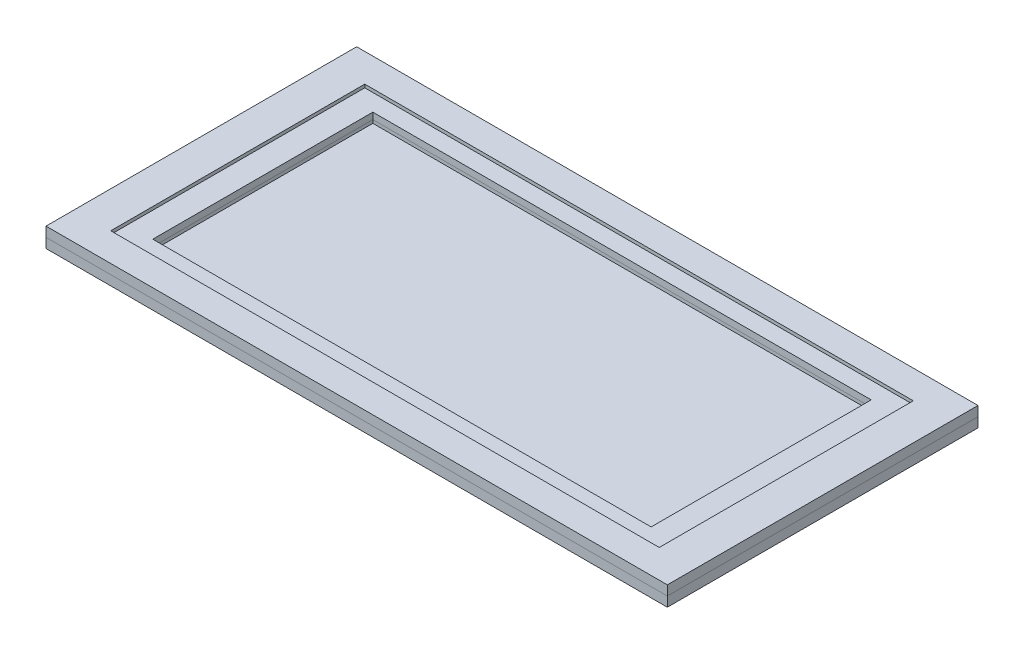
ISO-10303-21;
HEADER;
FILE_DESCRIPTION(('STEP AP214'),'2;1');
FILE_NAME('part.step','',(''),(''),'','','');
FILE_SCHEMA(('AUTOMOTIVE_DESIGN { 1 0 10303 214 1 1 1 1 }'));
ENDSEC;
DATA;
#1=APPLICATION_CONTEXT('core data for automotive mechanical design processes');
#2=APPLICATION_PROTOCOL_DEFINITION('international standard','automotive_design',2000,#1);
#3=PRODUCT_CONTEXT('',#1,'mechanical');
#4=PRODUCT('Part','Part','',(#3));
#5=PRODUCT_RELATED_PRODUCT_CATEGORY('part','',(#4));
#6=PRODUCT_DEFINITION_FORMATION('','',#4);
#7=PRODUCT_DEFINITION_CONTEXT('part definition',#1,'design');
#8=PRODUCT_DEFINITION('design','',#6,#7);
#9=PRODUCT_DEFINITION_SHAPE('','',#8);
#10=(LENGTH_UNIT() NAMED_UNIT(*) SI_UNIT(.MILLI.,.METRE.));
#11=(NAMED_UNIT(*) PLANE_ANGLE_UNIT() SI_UNIT($,.RADIAN.));
#12=(NAMED_UNIT(*) SI_UNIT($,.STERADIAN.) SOLID_ANGLE_UNIT());
#13=UNCERTAINTY_MEASURE_WITH_UNIT(LENGTH_MEASURE(1.E-05),#10,'distance_accuracy_value','');
#14=(GEOMETRIC_REPRESENTATION_CONTEXT(3) GLOBAL_UNCERTAINTY_ASSIGNED_CONTEXT((#13)) GLOBAL_UNIT_ASSIGNED_CONTEXT((#10,
#11,#12)) REPRESENTATION_CONTEXT('',''));
#15=CARTESIAN_POINT('',(0.,0.,0.));
#16=DIRECTION('',(0.,0.,1.));
#17=DIRECTION('',(1.,0.,0.));
#18=AXIS2_PLACEMENT_3D('',#15,#16,#17);
#19=CARTESIAN_POINT('',(-609.6,38.1,304.8));
#20=DIRECTION('',(1.,0.,0.));
#21=DIRECTION('',(0.,0.,-1.));
#22=AXIS2_PLACEMENT_3D('',#19,#20,#21);
#23=PLANE('',#22);
#24=DIRECTION('',(0.,0.,1.));
#25=VECTOR('',#24,1.);
#26=CARTESIAN_POINT('',(-609.6,19.05,304.8));
#27=LINE('',#26,#25);
#28=CARTESIAN_POINT('',(-609.6,19.05,-304.8));
#29=VERTEX_POINT('',#28);
#30=CARTESIAN_POINT('',(-609.6,19.05,304.8));
#31=VERTEX_POINT('',#30);
#32=EDGE_CURVE('E194',#29,#31,#27,.T.);
#33=ORIENTED_EDGE('',*,*,#32,.T.);
#34=DIRECTION('',(0.,-1.,0.));
#35=VECTOR('',#34,1.);
#36=CARTESIAN_POINT('',(-609.6,38.1,304.8));
#37=LINE('',#36,#35);
#38=CARTESIAN_POINT('',(-609.6,38.1,304.8));
#39=VERTEX_POINT('',#38);
#40=EDGE_CURVE('E12',#39,#31,#37,.T.);
#41=ORIENTED_EDGE('',*,*,#40,.F.);
#42=DIRECTION('',(0.,0.,1.));
#43=VECTOR('',#42,1.);
#44=CARTESIAN_POINT('',(-609.6,38.1,304.8));
#45=LINE('',#44,#43);
#46=CARTESIAN_POINT('',(-609.6,38.1,-304.8));
#47=VERTEX_POINT('',#46);
#48=EDGE_CURVE('E201',#47,#39,#45,.T.);
#49=ORIENTED_EDGE('',*,*,#48,.F.);
#50=DIRECTION('',(0.,-1.,0.));
#51=VECTOR('',#50,1.);
#52=CARTESIAN_POINT('',(-609.6,38.1,-304.8));
#53=LINE('',#52,#51);
#54=EDGE_CURVE('E211',#47,#29,#53,.T.);
#55=ORIENTED_EDGE('',*,*,#54,.T.);
#56=EDGE_LOOP('',(#33,#41,#49,#55));
#57=FACE_BOUND('',#56,.T.);
#58=ADVANCED_FACE('F43',(#57),#23,.F.);
#59=CARTESIAN_POINT('',(609.6,38.1,304.8));
#60=DIRECTION('',(0.,0.,-1.));
#61=DIRECTION('',(-1.,0.,0.));
#62=AXIS2_PLACEMENT_3D('',#59,#60,#61);
#63=PLANE('',#62);
#64=DIRECTION('',(1.,0.,0.));
#65=VECTOR('',#64,1.);
#66=CARTESIAN_POINT('',(609.6,19.05,304.8));
#67=LINE('',#66,#65);
#68=CARTESIAN_POINT('',(609.6,19.05,304.8));
#69=VERTEX_POINT('',#68);
#70=EDGE_CURVE('E214',#31,#69,#67,.T.);
#71=ORIENTED_EDGE('',*,*,#70,.T.);
#72=DIRECTION('',(0.,-1.,0.));
#73=VECTOR('',#72,1.);
#74=CARTESIAN_POINT('',(609.6,38.1,304.8));
#75=LINE('',#74,#73);
#76=CARTESIAN_POINT('',(609.6,38.1,304.8));
#77=VERTEX_POINT('',#76);
#78=EDGE_CURVE('E50',#77,#69,#75,.T.);
#79=ORIENTED_EDGE('',*,*,#78,.F.);
#80=DIRECTION('',(1.,0.,0.));
#81=VECTOR('',#80,1.);
#82=CARTESIAN_POINT('',(609.6,38.1,304.8));
#83=LINE('',#82,#81);
#84=EDGE_CURVE('E204',#39,#77,#83,.T.);
#85=ORIENTED_EDGE('',*,*,#84,.F.);
#86=ORIENTED_EDGE('',*,*,#40,.T.);
#87=EDGE_LOOP('',(#71,#79,#85,#86));
#88=FACE_BOUND('',#87,.T.);
#89=ADVANCED_FACE('F244',(#88),#63,.F.);
#90=CARTESIAN_POINT('',(609.6,38.1,304.8));
#91=DIRECTION('',(-1.,0.,0.));
#92=DIRECTION('',(0.,0.,1.));
#93=AXIS2_PLACEMENT_3D('',#90,#91,#92);
#94=PLANE('',#93);
#95=DIRECTION('',(0.,0.,-1.));
#96=VECTOR('',#95,1.);
#97=CARTESIAN_POINT('',(609.6,19.05,304.8));
#98=LINE('',#97,#96);
#99=CARTESIAN_POINT('',(609.6,19.05,-304.8));
#100=VERTEX_POINT('',#99);
#101=EDGE_CURVE('E216',#69,#100,#98,.T.);
#102=ORIENTED_EDGE('',*,*,#101,.T.);
#103=DIRECTION('',(0.,-1.,0.));
#104=VECTOR('',#103,1.);
#105=CARTESIAN_POINT('',(609.6,38.1,-304.8));
#106=LINE('',#105,#104);
#107=CARTESIAN_POINT('',(609.6,38.1,-304.8));
#108=VERTEX_POINT('',#107);
#109=EDGE_CURVE('E221',#108,#100,#106,.T.);
#110=ORIENTED_EDGE('',*,*,#109,.F.);
#111=DIRECTION('',(0.,0.,-1.));
#112=VECTOR('',#111,1.);
#113=CARTESIAN_POINT('',(609.6,38.1,304.8));
#114=LINE('',#113,#112);
#115=EDGE_CURVE('E207',#77,#108,#114,.T.);
#116=ORIENTED_EDGE('',*,*,#115,.F.);
#117=ORIENTED_EDGE('',*,*,#78,.T.);
#118=EDGE_LOOP('',(#102,#110,#116,#117));
#119=FACE_BOUND('',#118,.T.);
#120=ADVANCED_FACE('F228',(#119),#94,.F.);
#121=CARTESIAN_POINT('',(609.6,38.1,-304.8));
#122=DIRECTION('',(0.,0.,1.));
#123=DIRECTION('',(1.,0.,0.));
#124=AXIS2_PLACEMENT_3D('',#121,#122,#123);
#125=PLANE('',#124);
#126=DIRECTION('',(-1.,0.,0.));
#127=VECTOR('',#126,1.);
#128=CARTESIAN_POINT('',(609.6,19.05,-304.8));
#129=LINE('',#128,#127);
#130=EDGE_CURVE('E205',#100,#29,#129,.T.);
#131=ORIENTED_EDGE('',*,*,#130,.T.);
#132=ORIENTED_EDGE('',*,*,#54,.F.);
#133=DIRECTION('',(-1.,0.,0.));
#134=VECTOR('',#133,1.);
#135=CARTESIAN_POINT('',(609.6,38.1,-304.8));
#136=LINE('',#135,#134);
#137=EDGE_CURVE('E209',#108,#47,#136,.T.);
#138=ORIENTED_EDGE('',*,*,#137,.F.);
#139=ORIENTED_EDGE('',*,*,#109,.T.);
#140=EDGE_LOOP('',(#131,#132,#138,#139));
#141=FACE_BOUND('',#140,.T.);
#142=ADVANCED_FACE('F237',(#141),#125,.F.);
#143=CARTESIAN_POINT('',(0.,38.1,0.));
#144=DIRECTION('',(0.,1.,0.));
#145=DIRECTION('',(0.,0.,1.));
#146=AXIS2_PLACEMENT_3D('',#143,#144,#145);
#147=PLANE('',#146);
#148=DIRECTION('',(0.,0.,1.));
#149=VECTOR('',#148,1.);
#150=CARTESIAN_POINT('',(-538.1625,38.1,249.2375));
#151=LINE('',#150,#149);
#152=CARTESIAN_POINT('',(-538.1625,38.1,-249.2375));
#153=VERTEX_POINT('',#152);
#154=CARTESIAN_POINT('',(-538.1625,38.1,249.2375));
#155=VERTEX_POINT('',#154);
#156=EDGE_CURVE('E168',#153,#155,#151,.T.);
#157=ORIENTED_EDGE('',*,*,#156,.F.);
#158=DIRECTION('',(-1.,0.,0.));
#159=VECTOR('',#158,1.);
#160=CARTESIAN_POINT('',(538.1625,38.1,-249.2375));
#161=LINE('',#160,#159);
#162=CARTESIAN_POINT('',(538.1625,38.1,-249.2375));
#163=VERTEX_POINT('',#162);
#164=EDGE_CURVE('E173',#163,#153,#161,.T.);
#165=ORIENTED_EDGE('',*,*,#164,.F.);
#166=DIRECTION('',(0.,0.,-1.));
#167=VECTOR('',#166,1.);
#168=CARTESIAN_POINT('',(538.1625,38.1,249.2375));
#169=LINE('',#168,#167);
#170=CARTESIAN_POINT('',(538.1625,38.1,249.2375));
#171=VERTEX_POINT('',#170);
#172=EDGE_CURVE('E187',#171,#163,#169,.T.);
#173=ORIENTED_EDGE('',*,*,#172,.F.);
#174=DIRECTION('',(1.,0.,0.));
#175=VECTOR('',#174,1.);
#176=CARTESIAN_POINT('',(538.1625,38.1,249.2375));
#177=LINE('',#176,#175);
#178=EDGE_CURVE('E184',#155,#171,#177,.T.);
#179=ORIENTED_EDGE('',*,*,#178,.F.);
#180=EDGE_LOOP('',(#157,#165,#173,#179));
#181=FACE_BOUND('',#180,.T.);
#182=ORIENTED_EDGE('',*,*,#48,.T.);
#183=ORIENTED_EDGE('',*,*,#84,.T.);
#184=ORIENTED_EDGE('',*,*,#115,.T.);
#185=ORIENTED_EDGE('',*,*,#137,.T.);
#186=EDGE_LOOP('',(#182,#183,#184,#185));
#187=FACE_BOUND('',#186,.T.);
#188=ADVANCED_FACE('F243',(#181,#187),#147,.T.);
#189=CARTESIAN_POINT('',(0.,19.05,0.));
#190=DIRECTION('',(0.,1.,0.));
#191=DIRECTION('',(0.,0.,1.));
#192=AXIS2_PLACEMENT_3D('',#189,#190,#191);
#193=PLANE('',#192);
#194=DIRECTION('',(-1.,0.,0.));
#195=VECTOR('',#194,1.);
#196=CARTESIAN_POINT('',(0.,19.05,-215.9));
#197=LINE('',#196,#195);
#198=CARTESIAN_POINT('',(488.95,19.05,-215.9));
#199=VERTEX_POINT('',#198);
#200=CARTESIAN_POINT('',(-488.95,19.05,-215.9));
#201=VERTEX_POINT('',#200);
#202=EDGE_CURVE('E162',#199,#201,#197,.T.);
#203=ORIENTED_EDGE('',*,*,#202,.T.);
#204=DIRECTION('',(0.,0.,1.));
#205=VECTOR('',#204,1.);
#206=CARTESIAN_POINT('',(-488.95,19.05,0.));
#207=LINE('',#206,#205);
#208=CARTESIAN_POINT('',(-488.95,19.05,215.9));
#209=VERTEX_POINT('',#208);
#210=EDGE_CURVE('E165',#201,#209,#207,.T.);
#211=ORIENTED_EDGE('',*,*,#210,.T.);
#212=DIRECTION('',(1.,0.,0.));
#213=VECTOR('',#212,1.);
#214=CARTESIAN_POINT('',(0.,19.05,215.9));
#215=LINE('',#214,#213);
#216=CARTESIAN_POINT('',(488.95,19.05,215.9));
#217=VERTEX_POINT('',#216);
#218=EDGE_CURVE('E157',#209,#217,#215,.T.);
#219=ORIENTED_EDGE('',*,*,#218,.T.);
#220=DIRECTION('',(0.,0.,-1.));
#221=VECTOR('',#220,1.);
#222=CARTESIAN_POINT('',(488.95,19.05,0.));
#223=LINE('',#222,#221);
#224=EDGE_CURVE('E137',#217,#199,#223,.T.);
#225=ORIENTED_EDGE('',*,*,#224,.T.);
#226=EDGE_LOOP('',(#203,#211,#219,#225));
#227=FACE_BOUND('',#226,.T.);
#228=ORIENTED_EDGE('',*,*,#32,.F.);
#229=ORIENTED_EDGE('',*,*,#130,.F.);
#230=ORIENTED_EDGE('',*,*,#101,.F.);
#231=ORIENTED_EDGE('',*,*,#70,.F.);
#232=EDGE_LOOP('',(#228,#229,#230,#231));
#233=FACE_BOUND('',#232,.T.);
#234=ADVANCED_FACE('F234',(#227,#233),#193,.F.);
#235=CARTESIAN_POINT('',(-538.1625,31.75,249.2375));
#236=DIRECTION('',(-1.,0.,0.));
#237=DIRECTION('',(0.,0.,1.));
#238=AXIS2_PLACEMENT_3D('',#235,#236,#237);
#239=PLANE('',#238);
#240=ORIENTED_EDGE('',*,*,#156,.T.);
#241=DIRECTION('',(0.,1.,0.));
#242=VECTOR('',#241,1.);
#243=CARTESIAN_POINT('',(-538.1625,31.75,249.2375));
#244=LINE('',#243,#242);
#245=CARTESIAN_POINT('',(-538.1625,31.75,249.2375));
#246=VERTEX_POINT('',#245);
#247=EDGE_CURVE('E182',#246,#155,#244,.T.);
#248=ORIENTED_EDGE('',*,*,#247,.F.);
#249=DIRECTION('',(0.,0.,1.));
#250=VECTOR('',#249,1.);
#251=CARTESIAN_POINT('',(-538.1625,31.75,249.2375));
#252=LINE('',#251,#250);
#253=CARTESIAN_POINT('',(-538.1625,31.75,-249.2375));
#254=VERTEX_POINT('',#253);
#255=EDGE_CURVE('E169',#254,#246,#252,.T.);
#256=ORIENTED_EDGE('',*,*,#255,.F.);
#257=DIRECTION('',(0.,1.,0.));
#258=VECTOR('',#257,1.);
#259=CARTESIAN_POINT('',(-538.1625,31.75,-249.2375));
#260=LINE('',#259,#258);
#261=EDGE_CURVE('E192',#254,#153,#260,.T.);
#262=ORIENTED_EDGE('',*,*,#261,.T.);
#263=EDGE_LOOP('',(#240,#248,#256,#262));
#264=FACE_BOUND('',#263,.T.);
#265=ADVANCED_FACE('F256',(#264),#239,.F.);
#266=CARTESIAN_POINT('',(538.1625,31.75,-249.2375));
#267=DIRECTION('',(0.,0.,-1.));
#268=DIRECTION('',(-1.,0.,0.));
#269=AXIS2_PLACEMENT_3D('',#266,#267,#268);
#270=PLANE('',#269);
#271=ORIENTED_EDGE('',*,*,#164,.T.);
#272=ORIENTED_EDGE('',*,*,#261,.F.);
#273=DIRECTION('',(-1.,0.,0.));
#274=VECTOR('',#273,1.);
#275=CARTESIAN_POINT('',(538.1625,31.75,-249.2375));
#276=LINE('',#275,#274);
#277=CARTESIAN_POINT('',(538.1625,31.75,-249.2375));
#278=VERTEX_POINT('',#277);
#279=EDGE_CURVE('E179',#278,#254,#276,.T.);
#280=ORIENTED_EDGE('',*,*,#279,.F.);
#281=DIRECTION('',(0.,1.,0.));
#282=VECTOR('',#281,1.);
#283=CARTESIAN_POINT('',(538.1625,31.75,-249.2375));
#284=LINE('',#283,#282);
#285=EDGE_CURVE('E195',#278,#163,#284,.T.);
#286=ORIENTED_EDGE('',*,*,#285,.T.);
#287=EDGE_LOOP('',(#271,#272,#280,#286));
#288=FACE_BOUND('',#287,.T.);
#289=ADVANCED_FACE('F263',(#288),#270,.F.);
#290=CARTESIAN_POINT('',(538.1625,31.75,249.2375));
#291=DIRECTION('',(1.,0.,0.));
#292=DIRECTION('',(0.,0.,-1.));
#293=AXIS2_PLACEMENT_3D('',#290,#291,#292);
#294=PLANE('',#293);
#295=ORIENTED_EDGE('',*,*,#172,.T.);
#296=ORIENTED_EDGE('',*,*,#285,.F.);
#297=DIRECTION('',(0.,0.,-1.));
#298=VECTOR('',#297,1.);
#299=CARTESIAN_POINT('',(538.1625,31.75,249.2375));
#300=LINE('',#299,#298);
#301=CARTESIAN_POINT('',(538.1625,31.75,249.2375));
#302=VERTEX_POINT('',#301);
#303=EDGE_CURVE('E176',#302,#278,#300,.T.);
#304=ORIENTED_EDGE('',*,*,#303,.F.);
#305=DIRECTION('',(0.,1.,0.));
#306=VECTOR('',#305,1.);
#307=CARTESIAN_POINT('',(538.1625,31.75,249.2375));
#308=LINE('',#307,#306);
#309=EDGE_CURVE('E197',#302,#171,#308,.T.);
#310=ORIENTED_EDGE('',*,*,#309,.T.);
#311=EDGE_LOOP('',(#295,#296,#304,#310));
#312=FACE_BOUND('',#311,.T.);
#313=ADVANCED_FACE('F268',(#312),#294,.F.);
#314=CARTESIAN_POINT('',(538.1625,31.75,249.2375));
#315=DIRECTION('',(0.,0.,1.));
#316=DIRECTION('',(1.,0.,0.));
#317=AXIS2_PLACEMENT_3D('',#314,#315,#316);
#318=PLANE('',#317);
#319=ORIENTED_EDGE('',*,*,#178,.T.);
#320=ORIENTED_EDGE('',*,*,#309,.F.);
#321=DIRECTION('',(1.,0.,0.));
#322=VECTOR('',#321,1.);
#323=CARTESIAN_POINT('',(538.1625,31.75,249.2375));
#324=LINE('',#323,#322);
#325=EDGE_CURVE('E172',#246,#302,#324,.T.);
#326=ORIENTED_EDGE('',*,*,#325,.F.);
#327=ORIENTED_EDGE('',*,*,#247,.T.);
#328=EDGE_LOOP('',(#319,#320,#326,#327));
#329=FACE_BOUND('',#328,.T.);
#330=ADVANCED_FACE('F265',(#329),#318,.F.);
#331=CARTESIAN_POINT('',(0.,31.75,0.));
#332=DIRECTION('',(0.,1.,0.));
#333=DIRECTION('',(0.,0.,1.));
#334=AXIS2_PLACEMENT_3D('',#331,#332,#333);
#335=PLANE('',#334);
#336=DIRECTION('',(0.,0.,1.));
#337=VECTOR('',#336,1.);
#338=CARTESIAN_POINT('',(-488.95,31.75,215.9));
#339=LINE('',#338,#337);
#340=CARTESIAN_POINT('',(-488.95,31.75,-215.9));
#341=VERTEX_POINT('',#340);
#342=CARTESIAN_POINT('',(-488.95,31.75,215.9));
#343=VERTEX_POINT('',#342);
#344=EDGE_CURVE('E65',#341,#343,#339,.T.);
#345=ORIENTED_EDGE('',*,*,#344,.F.);
#346=DIRECTION('',(-1.,0.,0.));
#347=VECTOR('',#346,1.);
#348=CARTESIAN_POINT('',(488.95,31.75,-215.9));
#349=LINE('',#348,#347);
#350=CARTESIAN_POINT('',(488.95,31.75,-215.9));
#351=VERTEX_POINT('',#350);
#352=EDGE_CURVE('E150',#351,#341,#349,.T.);
#353=ORIENTED_EDGE('',*,*,#352,.F.);
#354=DIRECTION('',(0.,0.,-1.));
#355=VECTOR('',#354,1.);
#356=CARTESIAN_POINT('',(488.95,31.75,215.9));
#357=LINE('',#356,#355);
#358=CARTESIAN_POINT('',(488.95,31.75,215.9));
#359=VERTEX_POINT('',#358);
#360=EDGE_CURVE('E134',#359,#351,#357,.T.);
#361=ORIENTED_EDGE('',*,*,#360,.F.);
#362=DIRECTION('',(1.,0.,0.));
#363=VECTOR('',#362,1.);
#364=CARTESIAN_POINT('',(488.95,31.75,215.9));
#365=LINE('',#364,#363);
#366=EDGE_CURVE('E143',#343,#359,#365,.T.);
#367=ORIENTED_EDGE('',*,*,#366,.F.);
#368=EDGE_LOOP('',(#345,#353,#361,#367));
#369=FACE_BOUND('',#368,.T.);
#370=ORIENTED_EDGE('',*,*,#255,.T.);
#371=ORIENTED_EDGE('',*,*,#325,.T.);
#372=ORIENTED_EDGE('',*,*,#303,.T.);
#373=ORIENTED_EDGE('',*,*,#279,.T.);
#374=EDGE_LOOP('',(#370,#371,#372,#373));
#375=FACE_BOUND('',#374,.T.);
#376=ADVANCED_FACE('F147',(#369,#375),#335,.T.);
#377=CARTESIAN_POINT('',(-488.95,12.7,215.9));
#378=DIRECTION('',(-1.,0.,0.));
#379=DIRECTION('',(0.,0.,1.));
#380=AXIS2_PLACEMENT_3D('',#377,#378,#379);
#381=PLANE('',#380);
#382=DIRECTION('',(0.,1.,0.));
#383=VECTOR('',#382,1.);
#384=CARTESIAN_POINT('',(-488.95,12.7,-215.9));
#385=LINE('',#384,#383);
#386=EDGE_CURVE('E155',#201,#341,#385,.T.);
#387=ORIENTED_EDGE('',*,*,#386,.T.);
#388=ORIENTED_EDGE('',*,*,#344,.T.);
#389=DIRECTION('',(0.,1.,0.));
#390=VECTOR('',#389,1.);
#391=CARTESIAN_POINT('',(-488.95,12.7,215.9));
#392=LINE('',#391,#390);
#393=EDGE_CURVE('E140',#209,#343,#392,.T.);
#394=ORIENTED_EDGE('',*,*,#393,.F.);
#395=ORIENTED_EDGE('',*,*,#210,.F.);
#396=EDGE_LOOP('',(#387,#388,#394,#395));
#397=FACE_BOUND('',#396,.T.);
#398=ADVANCED_FACE('F278',(#397),#381,.F.);
#399=CARTESIAN_POINT('',(488.95,12.7,-215.9));
#400=DIRECTION('',(0.,0.,-1.));
#401=DIRECTION('',(-1.,0.,0.));
#402=AXIS2_PLACEMENT_3D('',#399,#400,#401);
#403=PLANE('',#402);
#404=DIRECTION('',(0.,1.,0.));
#405=VECTOR('',#404,1.);
#406=CARTESIAN_POINT('',(488.95,12.7,-215.9));
#407=LINE('',#406,#405);
#408=EDGE_CURVE('E139',#199,#351,#407,.T.);
#409=ORIENTED_EDGE('',*,*,#408,.T.);
#410=ORIENTED_EDGE('',*,*,#352,.T.);
#411=ORIENTED_EDGE('',*,*,#386,.F.);
#412=ORIENTED_EDGE('',*,*,#202,.F.);
#413=EDGE_LOOP('',(#409,#410,#411,#412));
#414=FACE_BOUND('',#413,.T.);
#415=ADVANCED_FACE('F281',(#414),#403,.F.);
#416=CARTESIAN_POINT('',(488.95,12.7,215.9));
#417=DIRECTION('',(1.,0.,0.));
#418=DIRECTION('',(0.,0.,-1.));
#419=AXIS2_PLACEMENT_3D('',#416,#417,#418);
#420=PLANE('',#419);
#421=DIRECTION('',(0.,1.,0.));
#422=VECTOR('',#421,1.);
#423=CARTESIAN_POINT('',(488.95,12.7,215.9));
#424=LINE('',#423,#422);
#425=EDGE_CURVE('E57',#217,#359,#424,.T.);
#426=ORIENTED_EDGE('',*,*,#425,.T.);
#427=ORIENTED_EDGE('',*,*,#360,.T.);
#428=ORIENTED_EDGE('',*,*,#408,.F.);
#429=ORIENTED_EDGE('',*,*,#224,.F.);
#430=EDGE_LOOP('',(#426,#427,#428,#429));
#431=FACE_BOUND('',#430,.T.);
#432=ADVANCED_FACE('F131',(#431),#420,.F.);
#433=CARTESIAN_POINT('',(488.95,12.7,215.9));
#434=DIRECTION('',(0.,0.,1.));
#435=DIRECTION('',(1.,0.,0.));
#436=AXIS2_PLACEMENT_3D('',#433,#434,#435);
#437=PLANE('',#436);
#438=ORIENTED_EDGE('',*,*,#393,.T.);
#439=ORIENTED_EDGE('',*,*,#366,.T.);
#440=ORIENTED_EDGE('',*,*,#425,.F.);
#441=ORIENTED_EDGE('',*,*,#218,.F.);
#442=EDGE_LOOP('',(#438,#439,#440,#441));
#443=FACE_BOUND('',#442,.T.);
#444=ADVANCED_FACE('F144',(#443),#437,.F.);
#445=CLOSED_SHELL('',(#58,#89,#120,#142,#188,#234,#265,#289,#313,#330,#376,#398,#415,#432,#444));
#446=MANIFOLD_SOLID_BREP('B2',#445);
#447=CARTESIAN_POINT('',(609.600000000001,19.05,304.8));
#448=DIRECTION('',(-1.,0.,0.));
#449=DIRECTION('',(0.,0.,1.));
#450=AXIS2_PLACEMENT_3D('',#447,#448,#449);
#451=PLANE('',#450);
#452=DIRECTION('',(0.,0.,-1.));
#453=VECTOR('',#452,1.);
#454=CARTESIAN_POINT('',(609.600000000001,0.,304.8));
#455=LINE('',#454,#453);
#456=CARTESIAN_POINT('',(609.600000000001,0.,304.8));
#457=VERTEX_POINT('',#456);
#458=CARTESIAN_POINT('',(609.600000000001,0.,-304.8));
#459=VERTEX_POINT('',#458);
#460=EDGE_CURVE('E487',#457,#459,#455,.T.);
#461=ORIENTED_EDGE('',*,*,#460,.T.);
#462=DIRECTION('',(0.,-1.,0.));
#463=VECTOR('',#462,1.);
#464=CARTESIAN_POINT('',(609.600000000001,19.05,-304.8));
#465=LINE('',#464,#463);
#466=CARTESIAN_POINT('',(609.600000000001,19.05,-304.8));
#467=VERTEX_POINT('',#466);
#468=EDGE_CURVE('E512',#467,#459,#465,.T.);
#469=ORIENTED_EDGE('',*,*,#468,.F.);
#470=DIRECTION('',(0.,0.,-1.));
#471=VECTOR('',#470,1.);
#472=CARTESIAN_POINT('',(609.600000000001,19.05,304.8));
#473=LINE('',#472,#471);
#474=CARTESIAN_POINT('',(609.600000000001,19.05,304.8));
#475=VERTEX_POINT('',#474);
#476=EDGE_CURVE('E492',#475,#467,#473,.T.);
#477=ORIENTED_EDGE('',*,*,#476,.F.);
#478=DIRECTION('',(0.,-1.,0.));
#479=VECTOR('',#478,1.);
#480=CARTESIAN_POINT('',(609.600000000001,19.05,304.8));
#481=LINE('',#480,#479);
#482=EDGE_CURVE('E498',#475,#457,#481,.T.);
#483=ORIENTED_EDGE('',*,*,#482,.T.);
#484=EDGE_LOOP('',(#461,#469,#477,#483));
#485=FACE_BOUND('',#484,.T.);
#486=ADVANCED_FACE('F388',(#485),#451,.F.);
#487=CARTESIAN_POINT('',(-609.6,19.05,-304.8));
#488=DIRECTION('',(0.,0.,1.));
#489=DIRECTION('',(1.,0.,0.));
#490=AXIS2_PLACEMENT_3D('',#487,#488,#489);
#491=PLANE('',#490);
#492=DIRECTION('',(-1.,0.,0.));
#493=VECTOR('',#492,1.);
#494=CARTESIAN_POINT('',(-609.6,0.,-304.8));
#495=LINE('',#494,#493);
#496=CARTESIAN_POINT('',(-609.6,0.,-304.8));
#497=VERTEX_POINT('',#496);
#498=EDGE_CURVE('E501',#459,#497,#495,.T.);
#499=ORIENTED_EDGE('',*,*,#498,.T.);
#500=DIRECTION('',(0.,-1.,0.));
#501=VECTOR('',#500,1.);
#502=CARTESIAN_POINT('',(-609.6,19.05,-304.8));
#503=LINE('',#502,#501);
#504=CARTESIAN_POINT('',(-609.6,19.05,-304.8));
#505=VERTEX_POINT('',#504);
#506=EDGE_CURVE('E509',#505,#497,#503,.T.);
#507=ORIENTED_EDGE('',*,*,#506,.F.);
#508=DIRECTION('',(-1.,0.,0.));
#509=VECTOR('',#508,1.);
#510=CARTESIAN_POINT('',(-609.6,19.05,-304.8));
#511=LINE('',#510,#509);
#512=EDGE_CURVE('E440',#467,#505,#511,.T.);
#513=ORIENTED_EDGE('',*,*,#512,.F.);
#514=ORIENTED_EDGE('',*,*,#468,.T.);
#515=EDGE_LOOP('',(#499,#507,#513,#514));
#516=FACE_BOUND('',#515,.T.);
#517=ADVANCED_FACE('F534',(#516),#491,.F.);
#518=CARTESIAN_POINT('',(-609.6,19.05,304.8));
#519=DIRECTION('',(1.,0.,0.));
#520=DIRECTION('',(0.,0.,-1.));
#521=AXIS2_PLACEMENT_3D('',#518,#519,#520);
#522=PLANE('',#521);
#523=DIRECTION('',(0.,0.,1.));
#524=VECTOR('',#523,1.);
#525=CARTESIAN_POINT('',(-609.6,0.,304.8));
#526=LINE('',#525,#524);
#527=CARTESIAN_POINT('',(-609.6,0.,304.8));
#528=VERTEX_POINT('',#527);
#529=EDGE_CURVE('E503',#497,#528,#526,.T.);
#530=ORIENTED_EDGE('',*,*,#529,.T.);
#531=DIRECTION('',(0.,-1.,0.));
#532=VECTOR('',#531,1.);
#533=CARTESIAN_POINT('',(-609.6,19.05,304.8));
#534=LINE('',#533,#532);
#535=CARTESIAN_POINT('',(-609.6,19.05,304.8));
#536=VERTEX_POINT('',#535);
#537=EDGE_CURVE('E507',#536,#528,#534,.T.);
#538=ORIENTED_EDGE('',*,*,#537,.F.);
#539=DIRECTION('',(0.,0.,1.));
#540=VECTOR('',#539,1.);
#541=CARTESIAN_POINT('',(-609.6,19.05,304.8));
#542=LINE('',#541,#540);
#543=EDGE_CURVE('E495',#505,#536,#542,.T.);
#544=ORIENTED_EDGE('',*,*,#543,.F.);
#545=ORIENTED_EDGE('',*,*,#506,.T.);
#546=EDGE_LOOP('',(#530,#538,#544,#545));
#547=FACE_BOUND('',#546,.T.);
#548=ADVANCED_FACE('F539',(#547),#522,.F.);
#549=CARTESIAN_POINT('',(-609.6,19.05,304.8));
#550=DIRECTION('',(0.,0.,-1.));
#551=DIRECTION('',(-1.,0.,0.));
#552=AXIS2_PLACEMENT_3D('',#549,#550,#551);
#553=PLANE('',#552);
#554=DIRECTION('',(1.,0.,0.));
#555=VECTOR('',#554,1.);
#556=CARTESIAN_POINT('',(-609.6,0.,304.8));
#557=LINE('',#556,#555);
#558=EDGE_CURVE('E432',#528,#457,#557,.T.);
#559=ORIENTED_EDGE('',*,*,#558,.T.);
#560=ORIENTED_EDGE('',*,*,#482,.F.);
#561=DIRECTION('',(1.,0.,0.));
#562=VECTOR('',#561,1.);
#563=CARTESIAN_POINT('',(-609.6,19.05,304.8));
#564=LINE('',#563,#562);
#565=EDGE_CURVE('E411',#536,#475,#564,.T.);
#566=ORIENTED_EDGE('',*,*,#565,.F.);
#567=ORIENTED_EDGE('',*,*,#537,.T.);
#568=EDGE_LOOP('',(#559,#560,#566,#567));
#569=FACE_BOUND('',#568,.T.);
#570=ADVANCED_FACE('F550',(#569),#553,.F.);
#571=CARTESIAN_POINT('',(0.,19.05,0.));
#572=DIRECTION('',(0.,-1.,0.));
#573=DIRECTION('',(0.,0.,-1.));
#574=AXIS2_PLACEMENT_3D('',#571,#572,#573);
#575=PLANE('',#574);
#576=DIRECTION('',(-1.,0.,0.));
#577=VECTOR('',#576,1.);
#578=CARTESIAN_POINT('',(0.,19.05,215.9));
#579=LINE('',#578,#577);
#580=CARTESIAN_POINT('',(488.95,19.05,215.9));
#581=VERTEX_POINT('',#580);
#582=CARTESIAN_POINT('',(-488.95,19.05,215.9));
#583=VERTEX_POINT('',#582);
#584=EDGE_CURVE('E514',#581,#583,#579,.T.);
#585=ORIENTED_EDGE('',*,*,#584,.T.);
#586=DIRECTION('',(0.,0.,-1.));
#587=VECTOR('',#586,1.);
#588=CARTESIAN_POINT('',(-488.95,19.05,0.));
#589=LINE('',#588,#587);
#590=CARTESIAN_POINT('',(-488.95,19.05,-215.9));
#591=VERTEX_POINT('',#590);
#592=EDGE_CURVE('E41',#583,#591,#589,.T.);
#593=ORIENTED_EDGE('',*,*,#592,.T.);
#594=DIRECTION('',(1.,0.,0.));
#595=VECTOR('',#594,1.);
#596=CARTESIAN_POINT('',(0.,19.05,-215.9));
#597=LINE('',#596,#595);
#598=CARTESIAN_POINT('',(488.95,19.05,-215.9));
#599=VERTEX_POINT('',#598);
#600=EDGE_CURVE('E395',#591,#599,#597,.T.);
#601=ORIENTED_EDGE('',*,*,#600,.T.);
#602=DIRECTION('',(0.,0.,1.));
#603=VECTOR('',#602,1.);
#604=CARTESIAN_POINT('',(488.95,19.05,0.));
#605=LINE('',#604,#603);
#606=EDGE_CURVE('E516',#599,#581,#605,.T.);
#607=ORIENTED_EDGE('',*,*,#606,.T.);
#608=EDGE_LOOP('',(#585,#593,#601,#607));
#609=FACE_BOUND('',#608,.T.);
#610=ORIENTED_EDGE('',*,*,#476,.T.);
#611=ORIENTED_EDGE('',*,*,#512,.T.);
#612=ORIENTED_EDGE('',*,*,#543,.T.);
#613=ORIENTED_EDGE('',*,*,#565,.T.);
#614=EDGE_LOOP('',(#610,#611,#612,#613));
#615=FACE_BOUND('',#614,.T.);
#616=ADVANCED_FACE('F520',(#609,#615),#575,.F.);
#617=CARTESIAN_POINT('',(0.,0.,0.));
#618=DIRECTION('',(0.,-1.,0.));
#619=DIRECTION('',(0.,0.,-1.));
#620=AXIS2_PLACEMENT_3D('',#617,#618,#619);
#621=PLANE('',#620);
#622=ORIENTED_EDGE('',*,*,#460,.F.);
#623=ORIENTED_EDGE('',*,*,#558,.F.);
#624=ORIENTED_EDGE('',*,*,#529,.F.);
#625=ORIENTED_EDGE('',*,*,#498,.F.);
#626=EDGE_LOOP('',(#622,#623,#624,#625));
#627=FACE_BOUND('',#626,.T.);
#628=ADVANCED_FACE('F544',(#627),#621,.T.);
#629=CARTESIAN_POINT('',(-488.95,12.7,215.9));
#630=DIRECTION('',(-1.,0.,0.));
#631=DIRECTION('',(0.,0.,1.));
#632=AXIS2_PLACEMENT_3D('',#629,#630,#631);
#633=PLANE('',#632);
#634=DIRECTION('',(0.,1.,0.));
#635=VECTOR('',#634,1.);
#636=CARTESIAN_POINT('',(-488.95,12.7,215.9));
#637=LINE('',#636,#635);
#638=CARTESIAN_POINT('',(-488.95,12.7,215.9));
#639=VERTEX_POINT('',#638);
#640=EDGE_CURVE('E402',#639,#583,#637,.T.);
#641=ORIENTED_EDGE('',*,*,#640,.F.);
#642=DIRECTION('',(0.,0.,1.));
#643=VECTOR('',#642,1.);
#644=CARTESIAN_POINT('',(-488.95,12.7,215.9));
#645=LINE('',#644,#643);
#646=CARTESIAN_POINT('',(-488.95,12.7,-215.9));
#647=VERTEX_POINT('',#646);
#648=EDGE_CURVE('E464',#647,#639,#645,.T.);
#649=ORIENTED_EDGE('',*,*,#648,.F.);
#650=DIRECTION('',(0.,1.,0.));
#651=VECTOR('',#650,1.);
#652=CARTESIAN_POINT('',(-488.95,12.7,-215.9));
#653=LINE('',#652,#651);
#654=EDGE_CURVE('E485',#647,#591,#653,.T.);
#655=ORIENTED_EDGE('',*,*,#654,.T.);
#656=ORIENTED_EDGE('',*,*,#592,.F.);
#657=EDGE_LOOP('',(#641,#649,#655,#656));
#658=FACE_BOUND('',#657,.T.);
#659=ADVANCED_FACE('F461',(#658),#633,.F.);
#660=CARTESIAN_POINT('',(488.95,12.7,-215.9));
#661=DIRECTION('',(0.,0.,-1.));
#662=DIRECTION('',(-1.,0.,0.));
#663=AXIS2_PLACEMENT_3D('',#660,#661,#662);
#664=PLANE('',#663);
#665=ORIENTED_EDGE('',*,*,#654,.F.);
#666=DIRECTION('',(-1.,0.,0.));
#667=VECTOR('',#666,1.);
#668=CARTESIAN_POINT('',(488.95,12.7,-215.9));
#669=LINE('',#668,#667);
#670=CARTESIAN_POINT('',(488.95,12.7,-215.9));
#671=VERTEX_POINT('',#670);
#672=EDGE_CURVE('E468',#671,#647,#669,.T.);
#673=ORIENTED_EDGE('',*,*,#672,.F.);
#674=DIRECTION('',(0.,1.,0.));
#675=VECTOR('',#674,1.);
#676=CARTESIAN_POINT('',(488.95,12.7,-215.9));
#677=LINE('',#676,#675);
#678=EDGE_CURVE('E488',#671,#599,#677,.T.);
#679=ORIENTED_EDGE('',*,*,#678,.T.);
#680=ORIENTED_EDGE('',*,*,#600,.F.);
#681=EDGE_LOOP('',(#665,#673,#679,#680));
#682=FACE_BOUND('',#681,.T.);
#683=ADVANCED_FACE('F522',(#682),#664,.F.);
#684=CARTESIAN_POINT('',(488.95,12.7,215.9));
#685=DIRECTION('',(1.,0.,0.));
#686=DIRECTION('',(0.,0.,-1.));
#687=AXIS2_PLACEMENT_3D('',#684,#685,#686);
#688=PLANE('',#687);
#689=ORIENTED_EDGE('',*,*,#678,.F.);
#690=DIRECTION('',(0.,0.,-1.));
#691=VECTOR('',#690,1.);
#692=CARTESIAN_POINT('',(488.95,12.7,215.9));
#693=LINE('',#692,#691);
#694=CARTESIAN_POINT('',(488.95,12.7,215.9));
#695=VERTEX_POINT('',#694);
#696=EDGE_CURVE('E477',#695,#671,#693,.T.);
#697=ORIENTED_EDGE('',*,*,#696,.F.);
#698=DIRECTION('',(0.,1.,0.));
#699=VECTOR('',#698,1.);
#700=CARTESIAN_POINT('',(488.95,12.7,215.9));
#701=LINE('',#700,#699);
#702=EDGE_CURVE('E467',#695,#581,#701,.T.);
#703=ORIENTED_EDGE('',*,*,#702,.T.);
#704=ORIENTED_EDGE('',*,*,#606,.F.);
#705=EDGE_LOOP('',(#689,#697,#703,#704));
#706=FACE_BOUND('',#705,.T.);
#707=ADVANCED_FACE('F524',(#706),#688,.F.);
#708=CARTESIAN_POINT('',(488.95,12.7,215.9));
#709=DIRECTION('',(0.,0.,1.));
#710=DIRECTION('',(1.,0.,0.));
#711=AXIS2_PLACEMENT_3D('',#708,#709,#710);
#712=PLANE('',#711);
#713=ORIENTED_EDGE('',*,*,#702,.F.);
#714=DIRECTION('',(1.,0.,0.));
#715=VECTOR('',#714,1.);
#716=CARTESIAN_POINT('',(488.95,12.7,215.9));
#717=LINE('',#716,#715);
#718=EDGE_CURVE('E471',#639,#695,#717,.T.);
#719=ORIENTED_EDGE('',*,*,#718,.F.);
#720=ORIENTED_EDGE('',*,*,#640,.T.);
#721=ORIENTED_EDGE('',*,*,#584,.F.);
#722=EDGE_LOOP('',(#713,#719,#720,#721));
#723=FACE_BOUND('',#722,.T.);
#724=ADVANCED_FACE('F472',(#723),#712,.F.);
#725=CARTESIAN_POINT('',(0.,12.7,0.));
#726=DIRECTION('',(0.,1.,0.));
#727=DIRECTION('',(0.,0.,1.));
#728=AXIS2_PLACEMENT_3D('',#725,#726,#727);
#729=PLANE('',#728);
#730=ORIENTED_EDGE('',*,*,#648,.T.);
#731=ORIENTED_EDGE('',*,*,#718,.T.);
#732=ORIENTED_EDGE('',*,*,#696,.T.);
#733=ORIENTED_EDGE('',*,*,#672,.T.);
#734=EDGE_LOOP('',(#730,#731,#732,#733));
#735=FACE_BOUND('',#734,.T.);
#736=ADVANCED_FACE('F479',(#735),#729,.T.);
#737=CLOSED_SHELL('',(#486,#517,#548,#570,#616,#628,#659,#683,#707,#724,#736));
#738=MANIFOLD_SOLID_BREP('B6',#737);
#739=ADVANCED_BREP_SHAPE_REPRESENTATION('',(#18,#446,#738),#14);
#740=SHAPE_DEFINITION_REPRESENTATION(#9,#739);
ENDSEC;
END-ISO-10303-21;
